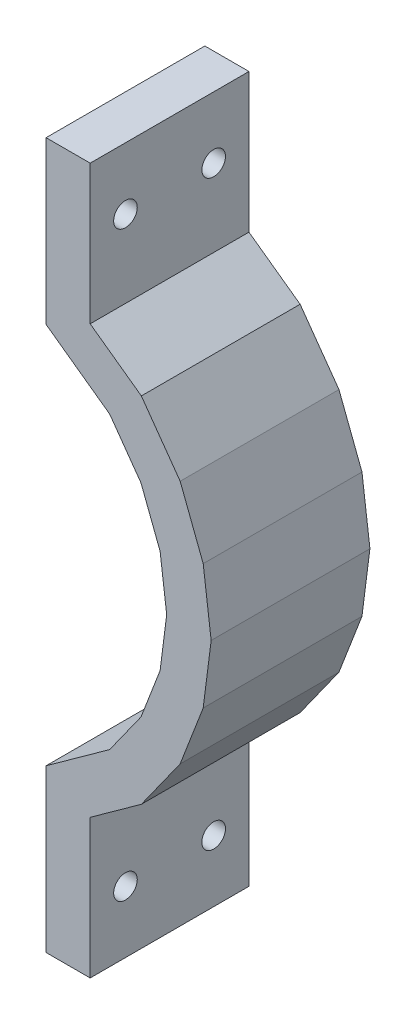
ISO-10303-21;
HEADER;
FILE_DESCRIPTION(('STEP AP214'),'2;1');
FILE_NAME('part.step','',(''),(''),'','','');
FILE_SCHEMA(('AUTOMOTIVE_DESIGN { 1 0 10303 214 1 1 1 1 }'));
ENDSEC;
DATA;
#1=APPLICATION_CONTEXT('core data for automotive mechanical design processes');
#2=APPLICATION_PROTOCOL_DEFINITION('international standard','automotive_design',2000,#1);
#3=PRODUCT_CONTEXT('',#1,'mechanical');
#4=PRODUCT('Part','Part','',(#3));
#5=PRODUCT_RELATED_PRODUCT_CATEGORY('part','',(#4));
#6=PRODUCT_DEFINITION_FORMATION('','',#4);
#7=PRODUCT_DEFINITION_CONTEXT('part definition',#1,'design');
#8=PRODUCT_DEFINITION('design','',#6,#7);
#9=PRODUCT_DEFINITION_SHAPE('','',#8);
#10=(LENGTH_UNIT() NAMED_UNIT(*) SI_UNIT(.MILLI.,.METRE.));
#11=(NAMED_UNIT(*) PLANE_ANGLE_UNIT() SI_UNIT($,.RADIAN.));
#12=(NAMED_UNIT(*) SI_UNIT($,.STERADIAN.) SOLID_ANGLE_UNIT());
#13=UNCERTAINTY_MEASURE_WITH_UNIT(LENGTH_MEASURE(1.E-05),#10,'distance_accuracy_value','');
#14=(GEOMETRIC_REPRESENTATION_CONTEXT(3) GLOBAL_UNCERTAINTY_ASSIGNED_CONTEXT((#13)) GLOBAL_UNIT_ASSIGNED_CONTEXT((#10,
#11,#12)) REPRESENTATION_CONTEXT('',''));
#15=CARTESIAN_POINT('',(0.,0.,0.));
#16=DIRECTION('',(0.,0.,1.));
#17=DIRECTION('',(1.,0.,0.));
#18=AXIS2_PLACEMENT_3D('',#15,#16,#17);
#19=CARTESIAN_POINT('',(35.3594623596526,-33.0325366885821,22.86));
#20=DIRECTION('',(1.,0.,0.));
#21=DIRECTION('',(0.,1.,0.));
#22=AXIS2_PLACEMENT_3D('',#19,#20,#21);
#23=PLANE('',#22);
#24=CARTESIAN_POINT('',(35.3594623596526,-47.42813206681,17.78));
#25=DIRECTION('',(1.,0.,0.));
#26=DIRECTION('',(0.,0.,-1.));
#27=AXIS2_PLACEMENT_3D('',#24,#25,#26);
#28=CIRCLE('',#27,1.69999999999999);
#29=CARTESIAN_POINT('',(35.3594623596526,-47.42813206681,16.08));
#30=VERTEX_POINT('',#29);
#31=EDGE_CURVE('E393',#30,#30,#28,.T.);
#32=ORIENTED_EDGE('',*,*,#31,.T.);
#33=EDGE_LOOP('',(#32));
#34=FACE_BOUND('',#33,.T.);
#35=CARTESIAN_POINT('',(35.3594623596526,-47.42813206681,5.08));
#36=DIRECTION('',(1.,0.,0.));
#37=DIRECTION('',(0.,0.,-1.));
#38=AXIS2_PLACEMENT_3D('',#35,#36,#37);
#39=CIRCLE('',#38,1.69999999999999);
#40=CARTESIAN_POINT('',(35.3594623596526,-47.42813206681,3.38000000000001));
#41=VERTEX_POINT('',#40);
#42=EDGE_CURVE('E218',#41,#41,#39,.T.);
#43=ORIENTED_EDGE('',*,*,#42,.T.);
#44=EDGE_LOOP('',(#43));
#45=FACE_BOUND('',#44,.T.);
#46=DIRECTION('',(0.,-1.,0.));
#47=VECTOR('',#46,1.);
#48=CARTESIAN_POINT('',(35.3594623596526,-33.0325366885821,0.));
#49=LINE('',#48,#47);
#50=CARTESIAN_POINT('',(35.3594623596526,-33.0325366885821,0.));
#51=VERTEX_POINT('',#50);
#52=CARTESIAN_POINT('',(35.3594623596526,-56.31813206681,0.));
#53=VERTEX_POINT('',#52);
#54=EDGE_CURVE('E214',#51,#53,#49,.T.);
#55=ORIENTED_EDGE('',*,*,#54,.T.);
#56=DIRECTION('',(0.,0.,-1.));
#57=VECTOR('',#56,1.);
#58=CARTESIAN_POINT('',(35.3594623596526,-56.31813206681,22.86));
#59=LINE('',#58,#57);
#60=CARTESIAN_POINT('',(35.3594623596526,-56.31813206681,22.86));
#61=VERTEX_POINT('',#60);
#62=EDGE_CURVE('E11',#61,#53,#59,.T.);
#63=ORIENTED_EDGE('',*,*,#62,.F.);
#64=DIRECTION('',(0.,-1.,0.));
#65=VECTOR('',#64,1.);
#66=CARTESIAN_POINT('',(35.3594623596526,-33.0325366885821,22.86));
#67=LINE('',#66,#65);
#68=CARTESIAN_POINT('',(35.3594623596526,-33.0325366885821,22.86));
#69=VERTEX_POINT('',#68);
#70=EDGE_CURVE('E257',#69,#61,#67,.T.);
#71=ORIENTED_EDGE('',*,*,#70,.F.);
#72=DIRECTION('',(0.,0.,-1.));
#73=VECTOR('',#72,1.);
#74=CARTESIAN_POINT('',(35.3594623596526,-33.0325366885821,22.86));
#75=LINE('',#74,#73);
#76=EDGE_CURVE('E210',#69,#51,#75,.T.);
#77=ORIENTED_EDGE('',*,*,#76,.T.);
#78=EDGE_LOOP('',(#55,#63,#71,#77));
#79=FACE_BOUND('',#78,.T.);
#80=ADVANCED_FACE('F34',(#34,#45,#79),#23,.F.);
#81=CARTESIAN_POINT('',(35.3594623596526,-56.31813206681,22.86));
#82=DIRECTION('',(0.,1.,0.));
#83=DIRECTION('',(0.,0.,1.));
#84=AXIS2_PLACEMENT_3D('',#81,#82,#83);
#85=PLANE('',#84);
#86=DIRECTION('',(1.,0.,0.));
#87=VECTOR('',#86,1.);
#88=CARTESIAN_POINT('',(35.3594623596526,-56.31813206681,0.));
#89=LINE('',#88,#87);
#90=CARTESIAN_POINT('',(41.7094623596526,-56.31813206681,0.));
#91=VERTEX_POINT('',#90);
#92=EDGE_CURVE('E217',#53,#91,#89,.T.);
#93=ORIENTED_EDGE('',*,*,#92,.T.);
#94=DIRECTION('',(0.,0.,-1.));
#95=VECTOR('',#94,1.);
#96=CARTESIAN_POINT('',(41.7094623596526,-56.31813206681,22.86));
#97=LINE('',#96,#95);
#98=CARTESIAN_POINT('',(41.7094623596526,-56.31813206681,22.86));
#99=VERTEX_POINT('',#98);
#100=EDGE_CURVE('E42',#99,#91,#97,.T.);
#101=ORIENTED_EDGE('',*,*,#100,.F.);
#102=DIRECTION('',(1.,0.,0.));
#103=VECTOR('',#102,1.);
#104=CARTESIAN_POINT('',(35.3594623596526,-56.31813206681,22.86));
#105=LINE('',#104,#103);
#106=EDGE_CURVE('E135',#61,#99,#105,.T.);
#107=ORIENTED_EDGE('',*,*,#106,.F.);
#108=ORIENTED_EDGE('',*,*,#62,.T.);
#109=EDGE_LOOP('',(#93,#101,#107,#108));
#110=FACE_BOUND('',#109,.T.);
#111=ADVANCED_FACE('F385',(#110),#85,.F.);
#112=CARTESIAN_POINT('',(41.7094623596526,-56.31813206681,22.86));
#113=DIRECTION('',(-1.,0.,0.));
#114=DIRECTION('',(0.,0.,1.));
#115=AXIS2_PLACEMENT_3D('',#112,#113,#114);
#116=PLANE('',#115);
#117=CARTESIAN_POINT('',(41.7094623596526,-47.42813206681,17.78));
#118=DIRECTION('',(1.,0.,0.));
#119=DIRECTION('',(0.,0.,-1.));
#120=AXIS2_PLACEMENT_3D('',#117,#118,#119);
#121=CIRCLE('',#120,1.69999999999999);
#122=CARTESIAN_POINT('',(41.7094623596526,-47.42813206681,16.08));
#123=VERTEX_POINT('',#122);
#124=EDGE_CURVE('E405',#123,#123,#121,.T.);
#125=ORIENTED_EDGE('',*,*,#124,.F.);
#126=EDGE_LOOP('',(#125));
#127=FACE_BOUND('',#126,.T.);
#128=CARTESIAN_POINT('',(41.7094623596526,-47.42813206681,5.08));
#129=DIRECTION('',(1.,0.,0.));
#130=DIRECTION('',(0.,0.,-1.));
#131=AXIS2_PLACEMENT_3D('',#128,#129,#130);
#132=CIRCLE('',#131,1.69999999999999);
#133=CARTESIAN_POINT('',(41.7094623596526,-47.42813206681,3.38000000000001));
#134=VERTEX_POINT('',#133);
#135=EDGE_CURVE('E397',#134,#134,#132,.T.);
#136=ORIENTED_EDGE('',*,*,#135,.F.);
#137=EDGE_LOOP('',(#136));
#138=FACE_BOUND('',#137,.T.);
#139=DIRECTION('',(0.,1.,0.));
#140=VECTOR('',#139,1.);
#141=CARTESIAN_POINT('',(41.7094623596526,-56.31813206681,0.));
#142=LINE('',#141,#140);
#143=CARTESIAN_POINT('',(41.7094623596526,-36.2837913650377,0.));
#144=VERTEX_POINT('',#143);
#145=EDGE_CURVE('E220',#91,#144,#142,.T.);
#146=ORIENTED_EDGE('',*,*,#145,.T.);
#147=DIRECTION('',(0.,0.,-1.));
#148=VECTOR('',#147,1.);
#149=CARTESIAN_POINT('',(41.7094623596526,-36.2837913650377,22.86));
#150=LINE('',#149,#148);
#151=CARTESIAN_POINT('',(41.7094623596526,-36.2837913650377,22.86));
#152=VERTEX_POINT('',#151);
#153=EDGE_CURVE('E306',#152,#144,#150,.T.);
#154=ORIENTED_EDGE('',*,*,#153,.F.);
#155=DIRECTION('',(0.,1.,0.));
#156=VECTOR('',#155,1.);
#157=CARTESIAN_POINT('',(41.7094623596526,-56.31813206681,22.86));
#158=LINE('',#157,#156);
#159=EDGE_CURVE('E314',#99,#152,#158,.T.);
#160=ORIENTED_EDGE('',*,*,#159,.F.);
#161=ORIENTED_EDGE('',*,*,#100,.T.);
#162=EDGE_LOOP('',(#146,#154,#160,#161));
#163=FACE_BOUND('',#162,.T.);
#164=ADVANCED_FACE('F312',(#127,#138,#163),#116,.F.);
#165=CARTESIAN_POINT('',(41.7094623596526,-36.2837913650377,22.86));
#166=DIRECTION('',(-0.584594173351775,0.811325860849483,0.));
#167=DIRECTION('',(-0.811325860849483,-0.584594173351775,0.));
#168=AXIS2_PLACEMENT_3D('',#165,#166,#167);
#169=PLANE('',#168);
#170=DIRECTION('',(0.811325860849483,0.584594173351775,0.));
#171=VECTOR('',#170,1.);
#172=CARTESIAN_POINT('',(41.7094623596526,-36.2837913650377,0.));
#173=LINE('',#172,#171);
#174=CARTESIAN_POINT('',(49.0748372221447,-30.9767311110279,0.));
#175=VERTEX_POINT('',#174);
#176=EDGE_CURVE('E222',#144,#175,#173,.T.);
#177=ORIENTED_EDGE('',*,*,#176,.T.);
#178=DIRECTION('',(0.,0.,-1.));
#179=VECTOR('',#178,1.);
#180=CARTESIAN_POINT('',(49.0748372221447,-30.9767311110279,22.86));
#181=LINE('',#180,#179);
#182=CARTESIAN_POINT('',(49.0748372221447,-30.9767311110279,22.86));
#183=VERTEX_POINT('',#182);
#184=EDGE_CURVE('E303',#183,#175,#181,.T.);
#185=ORIENTED_EDGE('',*,*,#184,.F.);
#186=DIRECTION('',(0.811325860849483,0.584594173351775,0.));
#187=VECTOR('',#186,1.);
#188=CARTESIAN_POINT('',(41.7094623596526,-36.2837913650377,22.86));
#189=LINE('',#188,#187);
#190=EDGE_CURVE('E332',#152,#183,#189,.T.);
#191=ORIENTED_EDGE('',*,*,#190,.F.);
#192=ORIENTED_EDGE('',*,*,#153,.T.);
#193=EDGE_LOOP('',(#177,#185,#191,#192));
#194=FACE_BOUND('',#193,.T.);
#195=ADVANCED_FACE('F323',(#194),#169,.F.);
#196=CARTESIAN_POINT('',(49.0748372221447,-30.9767311110279,22.86));
#197=DIRECTION('',(-0.814138939313214,0.580670119339677,0.));
#198=DIRECTION('',(-0.580670119339677,-0.814138939313214,0.));
#199=AXIS2_PLACEMENT_3D('',#196,#197,#198);
#200=PLANE('',#199);
#201=DIRECTION('',(0.580670119339677,0.814138939313214,0.));
#202=VECTOR('',#201,1.);
#203=CARTESIAN_POINT('',(49.0748372221447,-30.9767311110279,0.));
#204=LINE('',#203,#202);
#205=CARTESIAN_POINT('',(54.665181835906,-23.1386883348324,0.));
#206=VERTEX_POINT('',#205);
#207=EDGE_CURVE('E224',#175,#206,#204,.T.);
#208=ORIENTED_EDGE('',*,*,#207,.T.);
#209=DIRECTION('',(0.,0.,-1.));
#210=VECTOR('',#209,1.);
#211=CARTESIAN_POINT('',(54.665181835906,-23.1386883348324,22.86));
#212=LINE('',#211,#210);
#213=CARTESIAN_POINT('',(54.665181835906,-23.1386883348324,22.86));
#214=VERTEX_POINT('',#213);
#215=EDGE_CURVE('E300',#214,#206,#212,.T.);
#216=ORIENTED_EDGE('',*,*,#215,.F.);
#217=DIRECTION('',(0.580670119339677,0.814138939313214,0.));
#218=VECTOR('',#217,1.);
#219=CARTESIAN_POINT('',(49.0748372221447,-30.9767311110279,22.86));
#220=LINE('',#219,#218);
#221=EDGE_CURVE('E329',#183,#214,#220,.T.);
#222=ORIENTED_EDGE('',*,*,#221,.F.);
#223=ORIENTED_EDGE('',*,*,#184,.T.);
#224=EDGE_LOOP('',(#208,#216,#222,#223));
#225=FACE_BOUND('',#224,.T.);
#226=ADVANCED_FACE('F327',(#225),#200,.F.);
#227=CARTESIAN_POINT('',(54.665181835906,-23.1386883348324,22.86));
#228=DIRECTION('',(-0.933394369488488,0.358852269056765,0.));
#229=DIRECTION('',(-0.358852269056765,-0.933394369488488,0.));
#230=AXIS2_PLACEMENT_3D('',#227,#228,#229);
#231=PLANE('',#230);
#232=DIRECTION('',(0.358852269056765,0.933394369488488,0.));
#233=VECTOR('',#232,1.);
#234=CARTESIAN_POINT('',(54.665181835906,-23.1386883348324,0.));
#235=LINE('',#234,#233);
#236=CARTESIAN_POINT('',(57.9800590706334,-14.516511430189,0.));
#237=VERTEX_POINT('',#236);
#238=EDGE_CURVE('E226',#206,#237,#235,.T.);
#239=ORIENTED_EDGE('',*,*,#238,.T.);
#240=DIRECTION('',(0.,0.,-1.));
#241=VECTOR('',#240,1.);
#242=CARTESIAN_POINT('',(57.9800590706334,-14.516511430189,22.86));
#243=LINE('',#242,#241);
#244=CARTESIAN_POINT('',(57.9800590706334,-14.516511430189,22.86));
#245=VERTEX_POINT('',#244);
#246=EDGE_CURVE('E297',#245,#237,#243,.T.);
#247=ORIENTED_EDGE('',*,*,#246,.F.);
#248=DIRECTION('',(0.358852269056765,0.933394369488488,0.));
#249=VECTOR('',#248,1.);
#250=CARTESIAN_POINT('',(54.665181835906,-23.1386883348324,22.86));
#251=LINE('',#250,#249);
#252=EDGE_CURVE('E331',#214,#245,#251,.T.);
#253=ORIENTED_EDGE('',*,*,#252,.F.);
#254=ORIENTED_EDGE('',*,*,#215,.T.);
#255=EDGE_LOOP('',(#239,#247,#253,#254));
#256=FACE_BOUND('',#255,.T.);
#257=ADVANCED_FACE('F477',(#256),#231,.F.);
#258=CARTESIAN_POINT('',(57.9800590706334,-14.516511430189,22.86));
#259=DIRECTION('',(-0.991996900043617,0.126262228333946,0.));
#260=DIRECTION('',(-0.126262228333946,-0.991996900043617,0.));
#261=AXIS2_PLACEMENT_3D('',#258,#259,#260);
#262=PLANE('',#261);
#263=DIRECTION('',(0.126262228333946,0.991996900043617,0.));
#264=VECTOR('',#263,1.);
#265=CARTESIAN_POINT('',(57.9800590706334,-14.516511430189,0.));
#266=LINE('',#265,#264);
#267=CARTESIAN_POINT('',(59.1253806233162,-5.5181320668099,0.));
#268=VERTEX_POINT('',#267);
#269=EDGE_CURVE('E228',#237,#268,#266,.T.);
#270=ORIENTED_EDGE('',*,*,#269,.T.);
#271=DIRECTION('',(0.,0.,-1.));
#272=VECTOR('',#271,1.);
#273=CARTESIAN_POINT('',(59.1253806233162,-5.5181320668099,22.86));
#274=LINE('',#273,#272);
#275=CARTESIAN_POINT('',(59.1253806233162,-5.5181320668099,22.86));
#276=VERTEX_POINT('',#275);
#277=EDGE_CURVE('E294',#276,#268,#274,.T.);
#278=ORIENTED_EDGE('',*,*,#277,.F.);
#279=DIRECTION('',(0.126262228333946,0.991996900043617,0.));
#280=VECTOR('',#279,1.);
#281=CARTESIAN_POINT('',(57.9800590706334,-14.516511430189,22.86));
#282=LINE('',#281,#280);
#283=EDGE_CURVE('E334',#245,#276,#282,.T.);
#284=ORIENTED_EDGE('',*,*,#283,.F.);
#285=ORIENTED_EDGE('',*,*,#246,.T.);
#286=EDGE_LOOP('',(#270,#278,#284,#285));
#287=FACE_BOUND('',#286,.T.);
#288=ADVANCED_FACE('F473',(#287),#262,.F.);
#289=CARTESIAN_POINT('',(57.9800590706334,3.48024729656917,22.86));
#290=DIRECTION('',(-0.991996900043617,-0.126262228333946,0.));
#291=DIRECTION('',(0.126262228333946,-0.991996900043617,0.));
#292=AXIS2_PLACEMENT_3D('',#289,#290,#291);
#293=PLANE('',#292);
#294=DIRECTION('',(-0.126262228333946,0.991996900043617,0.));
#295=VECTOR('',#294,1.);
#296=CARTESIAN_POINT('',(57.9800590706334,3.48024729656917,0.));
#297=LINE('',#296,#295);
#298=CARTESIAN_POINT('',(57.9800590706334,3.48024729656917,0.));
#299=VERTEX_POINT('',#298);
#300=EDGE_CURVE('E230',#268,#299,#297,.T.);
#301=ORIENTED_EDGE('',*,*,#300,.T.);
#302=DIRECTION('',(0.,0.,-1.));
#303=VECTOR('',#302,1.);
#304=CARTESIAN_POINT('',(57.9800590706334,3.48024729656917,22.86));
#305=LINE('',#304,#303);
#306=CARTESIAN_POINT('',(57.9800590706334,3.48024729656917,22.86));
#307=VERTEX_POINT('',#306);
#308=EDGE_CURVE('E291',#307,#299,#305,.T.);
#309=ORIENTED_EDGE('',*,*,#308,.F.);
#310=DIRECTION('',(-0.126262228333946,0.991996900043617,0.));
#311=VECTOR('',#310,1.);
#312=CARTESIAN_POINT('',(57.9800590706334,3.48024729656917,22.86));
#313=LINE('',#312,#311);
#314=EDGE_CURVE('E340',#276,#307,#313,.T.);
#315=ORIENTED_EDGE('',*,*,#314,.F.);
#316=ORIENTED_EDGE('',*,*,#277,.T.);
#317=EDGE_LOOP('',(#301,#309,#315,#316));
#318=FACE_BOUND('',#317,.T.);
#319=ADVANCED_FACE('F469',(#318),#293,.F.);
#320=CARTESIAN_POINT('',(54.665181835906,12.1024242012125,22.86));
#321=DIRECTION('',(-0.933394369488488,-0.358852269056765,0.));
#322=DIRECTION('',(0.358852269056765,-0.933394369488488,0.));
#323=AXIS2_PLACEMENT_3D('',#320,#321,#322);
#324=PLANE('',#323);
#325=DIRECTION('',(-0.358852269056765,0.933394369488488,0.));
#326=VECTOR('',#325,1.);
#327=CARTESIAN_POINT('',(54.665181835906,12.1024242012125,0.));
#328=LINE('',#327,#326);
#329=CARTESIAN_POINT('',(54.665181835906,12.1024242012125,0.));
#330=VERTEX_POINT('',#329);
#331=EDGE_CURVE('E232',#299,#330,#328,.T.);
#332=ORIENTED_EDGE('',*,*,#331,.T.);
#333=DIRECTION('',(0.,0.,-1.));
#334=VECTOR('',#333,1.);
#335=CARTESIAN_POINT('',(54.665181835906,12.1024242012125,22.86));
#336=LINE('',#335,#334);
#337=CARTESIAN_POINT('',(54.665181835906,12.1024242012125,22.86));
#338=VERTEX_POINT('',#337);
#339=EDGE_CURVE('E288',#338,#330,#336,.T.);
#340=ORIENTED_EDGE('',*,*,#339,.F.);
#341=DIRECTION('',(-0.358852269056765,0.933394369488488,0.));
#342=VECTOR('',#341,1.);
#343=CARTESIAN_POINT('',(54.665181835906,12.1024242012125,22.86));
#344=LINE('',#343,#342);
#345=EDGE_CURVE('E342',#307,#338,#344,.T.);
#346=ORIENTED_EDGE('',*,*,#345,.F.);
#347=ORIENTED_EDGE('',*,*,#308,.T.);
#348=EDGE_LOOP('',(#332,#340,#346,#347));
#349=FACE_BOUND('',#348,.T.);
#350=ADVANCED_FACE('F465',(#349),#324,.F.);
#351=CARTESIAN_POINT('',(49.0748372221447,19.9404669774081,22.86));
#352=DIRECTION('',(-0.814138939313214,-0.580670119339677,0.));
#353=DIRECTION('',(0.580670119339677,-0.814138939313214,0.));
#354=AXIS2_PLACEMENT_3D('',#351,#352,#353);
#355=PLANE('',#354);
#356=DIRECTION('',(-0.580670119339677,0.814138939313214,0.));
#357=VECTOR('',#356,1.);
#358=CARTESIAN_POINT('',(49.0748372221447,19.9404669774081,0.));
#359=LINE('',#358,#357);
#360=CARTESIAN_POINT('',(49.0748372221447,19.9404669774081,0.));
#361=VERTEX_POINT('',#360);
#362=EDGE_CURVE('E234',#330,#361,#359,.T.);
#363=ORIENTED_EDGE('',*,*,#362,.T.);
#364=DIRECTION('',(0.,0.,-1.));
#365=VECTOR('',#364,1.);
#366=CARTESIAN_POINT('',(49.0748372221447,19.9404669774081,22.86));
#367=LINE('',#366,#365);
#368=CARTESIAN_POINT('',(49.0748372221447,19.9404669774081,22.86));
#369=VERTEX_POINT('',#368);
#370=EDGE_CURVE('E285',#369,#361,#367,.T.);
#371=ORIENTED_EDGE('',*,*,#370,.F.);
#372=DIRECTION('',(-0.580670119339677,0.814138939313214,0.));
#373=VECTOR('',#372,1.);
#374=CARTESIAN_POINT('',(49.0748372221447,19.9404669774081,22.86));
#375=LINE('',#374,#373);
#376=EDGE_CURVE('E344',#338,#369,#375,.T.);
#377=ORIENTED_EDGE('',*,*,#376,.F.);
#378=ORIENTED_EDGE('',*,*,#339,.T.);
#379=EDGE_LOOP('',(#363,#371,#377,#378));
#380=FACE_BOUND('',#379,.T.);
#381=ADVANCED_FACE('F461',(#380),#355,.F.);
#382=CARTESIAN_POINT('',(41.7094623596526,25.2475272314178,22.86));
#383=DIRECTION('',(-0.584594173351776,-0.811325860849482,0.));
#384=DIRECTION('',(0.811325860849482,-0.584594173351776,0.));
#385=AXIS2_PLACEMENT_3D('',#382,#383,#384);
#386=PLANE('',#385);
#387=DIRECTION('',(-0.811325860849482,0.584594173351776,0.));
#388=VECTOR('',#387,1.);
#389=CARTESIAN_POINT('',(41.7094623596526,25.2475272314178,0.));
#390=LINE('',#389,#388);
#391=CARTESIAN_POINT('',(41.7094623596526,25.2475272314178,0.));
#392=VERTEX_POINT('',#391);
#393=EDGE_CURVE('E236',#361,#392,#390,.T.);
#394=ORIENTED_EDGE('',*,*,#393,.T.);
#395=DIRECTION('',(0.,0.,-1.));
#396=VECTOR('',#395,1.);
#397=CARTESIAN_POINT('',(41.7094623596526,25.2475272314178,22.86));
#398=LINE('',#397,#396);
#399=CARTESIAN_POINT('',(41.7094623596526,25.2475272314178,22.86));
#400=VERTEX_POINT('',#399);
#401=EDGE_CURVE('E282',#400,#392,#398,.T.);
#402=ORIENTED_EDGE('',*,*,#401,.F.);
#403=DIRECTION('',(-0.811325860849482,0.584594173351776,0.));
#404=VECTOR('',#403,1.);
#405=CARTESIAN_POINT('',(41.7094623596526,25.2475272314178,22.86));
#406=LINE('',#405,#404);
#407=EDGE_CURVE('E346',#369,#400,#406,.T.);
#408=ORIENTED_EDGE('',*,*,#407,.F.);
#409=ORIENTED_EDGE('',*,*,#370,.T.);
#410=EDGE_LOOP('',(#394,#402,#408,#409));
#411=FACE_BOUND('',#410,.T.);
#412=ADVANCED_FACE('F427',(#411),#386,.F.);
#413=CARTESIAN_POINT('',(41.7094623596526,25.2475272314178,22.86));
#414=DIRECTION('',(-1.,0.,0.));
#415=DIRECTION('',(0.,-1.,0.));
#416=AXIS2_PLACEMENT_3D('',#413,#414,#415);
#417=PLANE('',#416);
#418=CARTESIAN_POINT('',(41.7094623596526,36.39186793319,17.78));
#419=DIRECTION('',(1.,0.,0.));
#420=DIRECTION('',(0.,0.,-1.));
#421=AXIS2_PLACEMENT_3D('',#418,#419,#420);
#422=CIRCLE('',#421,1.69999999999999);
#423=CARTESIAN_POINT('',(41.7094623596526,36.39186793319,16.08));
#424=VERTEX_POINT('',#423);
#425=EDGE_CURVE('E417',#424,#424,#422,.T.);
#426=ORIENTED_EDGE('',*,*,#425,.F.);
#427=EDGE_LOOP('',(#426));
#428=FACE_BOUND('',#427,.T.);
#429=CARTESIAN_POINT('',(41.7094623596526,36.39186793319,5.08));
#430=DIRECTION('',(1.,0.,0.));
#431=DIRECTION('',(0.,0.,-1.));
#432=AXIS2_PLACEMENT_3D('',#429,#430,#431);
#433=CIRCLE('',#432,1.69999999999999);
#434=CARTESIAN_POINT('',(41.7094623596526,36.39186793319,3.38000000000001));
#435=VERTEX_POINT('',#434);
#436=EDGE_CURVE('E411',#435,#435,#433,.T.);
#437=ORIENTED_EDGE('',*,*,#436,.F.);
#438=EDGE_LOOP('',(#437));
#439=FACE_BOUND('',#438,.T.);
#440=DIRECTION('',(0.,1.,0.));
#441=VECTOR('',#440,1.);
#442=CARTESIAN_POINT('',(41.7094623596526,25.2475272314178,0.));
#443=LINE('',#442,#441);
#444=CARTESIAN_POINT('',(41.7094623596526,45.28186793319,0.));
#445=VERTEX_POINT('',#444);
#446=EDGE_CURVE('E238',#392,#445,#443,.T.);
#447=ORIENTED_EDGE('',*,*,#446,.T.);
#448=DIRECTION('',(0.,0.,-1.));
#449=VECTOR('',#448,1.);
#450=CARTESIAN_POINT('',(41.7094623596526,45.28186793319,22.86));
#451=LINE('',#450,#449);
#452=CARTESIAN_POINT('',(41.7094623596526,45.28186793319,22.86));
#453=VERTEX_POINT('',#452);
#454=EDGE_CURVE('E279',#453,#445,#451,.T.);
#455=ORIENTED_EDGE('',*,*,#454,.F.);
#456=DIRECTION('',(0.,1.,0.));
#457=VECTOR('',#456,1.);
#458=CARTESIAN_POINT('',(41.7094623596526,25.2475272314178,22.86));
#459=LINE('',#458,#457);
#460=EDGE_CURVE('E348',#400,#453,#459,.T.);
#461=ORIENTED_EDGE('',*,*,#460,.F.);
#462=ORIENTED_EDGE('',*,*,#401,.T.);
#463=EDGE_LOOP('',(#447,#455,#461,#462));
#464=FACE_BOUND('',#463,.T.);
#465=ADVANCED_FACE('F423',(#428,#439,#464),#417,.F.);
#466=CARTESIAN_POINT('',(35.3594623596526,45.28186793319,22.86));
#467=DIRECTION('',(0.,-1.,0.));
#468=DIRECTION('',(0.,0.,-1.));
#469=AXIS2_PLACEMENT_3D('',#466,#467,#468);
#470=PLANE('',#469);
#471=DIRECTION('',(-1.,0.,0.));
#472=VECTOR('',#471,1.);
#473=CARTESIAN_POINT('',(35.3594623596526,45.28186793319,0.));
#474=LINE('',#473,#472);
#475=CARTESIAN_POINT('',(35.3594623596526,45.28186793319,0.));
#476=VERTEX_POINT('',#475);
#477=EDGE_CURVE('E240',#445,#476,#474,.T.);
#478=ORIENTED_EDGE('',*,*,#477,.T.);
#479=DIRECTION('',(0.,0.,-1.));
#480=VECTOR('',#479,1.);
#481=CARTESIAN_POINT('',(35.3594623596526,45.28186793319,22.86));
#482=LINE('',#481,#480);
#483=CARTESIAN_POINT('',(35.3594623596526,45.28186793319,22.86));
#484=VERTEX_POINT('',#483);
#485=EDGE_CURVE('E276',#484,#476,#482,.T.);
#486=ORIENTED_EDGE('',*,*,#485,.F.);
#487=DIRECTION('',(-1.,0.,0.));
#488=VECTOR('',#487,1.);
#489=CARTESIAN_POINT('',(35.3594623596526,45.28186793319,22.86));
#490=LINE('',#489,#488);
#491=EDGE_CURVE('E350',#453,#484,#490,.T.);
#492=ORIENTED_EDGE('',*,*,#491,.F.);
#493=ORIENTED_EDGE('',*,*,#454,.T.);
#494=EDGE_LOOP('',(#478,#486,#492,#493));
#495=FACE_BOUND('',#494,.T.);
#496=ADVANCED_FACE('F426',(#495),#470,.F.);
#497=CARTESIAN_POINT('',(35.3594623596526,45.28186793319,22.86));
#498=DIRECTION('',(1.,0.,0.));
#499=DIRECTION('',(0.,1.,0.));
#500=AXIS2_PLACEMENT_3D('',#497,#498,#499);
#501=PLANE('',#500);
#502=CARTESIAN_POINT('',(35.3594623596526,36.39186793319,17.78));
#503=DIRECTION('',(1.,0.,0.));
#504=DIRECTION('',(0.,0.,-1.));
#505=AXIS2_PLACEMENT_3D('',#502,#503,#504);
#506=CIRCLE('',#505,1.69999999999999);
#507=CARTESIAN_POINT('',(35.3594623596526,36.39186793319,16.08));
#508=VERTEX_POINT('',#507);
#509=EDGE_CURVE('E414',#508,#508,#506,.T.);
#510=ORIENTED_EDGE('',*,*,#509,.T.);
#511=EDGE_LOOP('',(#510));
#512=FACE_BOUND('',#511,.T.);
#513=CARTESIAN_POINT('',(35.3594623596526,36.39186793319,5.08));
#514=DIRECTION('',(1.,0.,0.));
#515=DIRECTION('',(0.,0.,-1.));
#516=AXIS2_PLACEMENT_3D('',#513,#514,#515);
#517=CIRCLE('',#516,1.69999999999999);
#518=CARTESIAN_POINT('',(35.3594623596526,36.39186793319,3.38000000000001));
#519=VERTEX_POINT('',#518);
#520=EDGE_CURVE('E408',#519,#519,#517,.T.);
#521=ORIENTED_EDGE('',*,*,#520,.T.);
#522=EDGE_LOOP('',(#521));
#523=FACE_BOUND('',#522,.T.);
#524=DIRECTION('',(0.,-1.,0.));
#525=VECTOR('',#524,1.);
#526=CARTESIAN_POINT('',(35.3594623596526,45.28186793319,0.));
#527=LINE('',#526,#525);
#528=CARTESIAN_POINT('',(35.3594623596526,21.9962725549622,0.));
#529=VERTEX_POINT('',#528);
#530=EDGE_CURVE('E242',#476,#529,#527,.T.);
#531=ORIENTED_EDGE('',*,*,#530,.T.);
#532=DIRECTION('',(0.,0.,-1.));
#533=VECTOR('',#532,1.);
#534=CARTESIAN_POINT('',(35.3594623596526,21.9962725549622,22.86));
#535=LINE('',#534,#533);
#536=CARTESIAN_POINT('',(35.3594623596526,21.9962725549622,22.86));
#537=VERTEX_POINT('',#536);
#538=EDGE_CURVE('E273',#537,#529,#535,.T.);
#539=ORIENTED_EDGE('',*,*,#538,.F.);
#540=DIRECTION('',(0.,-1.,0.));
#541=VECTOR('',#540,1.);
#542=CARTESIAN_POINT('',(35.3594623596526,45.28186793319,22.86));
#543=LINE('',#542,#541);
#544=EDGE_CURVE('E352',#484,#537,#543,.T.);
#545=ORIENTED_EDGE('',*,*,#544,.F.);
#546=ORIENTED_EDGE('',*,*,#485,.T.);
#547=EDGE_LOOP('',(#531,#539,#545,#546));
#548=FACE_BOUND('',#547,.T.);
#549=ADVANCED_FACE('F445',(#512,#523,#548),#501,.F.);
#550=CARTESIAN_POINT('',(35.3594623596526,21.9962725549622,22.86));
#551=DIRECTION('',(0.584594173351775,0.811325860849483,0.));
#552=DIRECTION('',(-0.811325860849483,0.584594173351775,0.));
#553=AXIS2_PLACEMENT_3D('',#550,#551,#552);
#554=PLANE('',#553);
#555=DIRECTION('',(0.811325860849483,-0.584594173351775,0.));
#556=VECTOR('',#555,1.);
#557=CARTESIAN_POINT('',(35.3594623596526,21.9962725549622,0.));
#558=LINE('',#557,#556);
#559=CARTESIAN_POINT('',(44.5130956108117,15.400697432996,0.));
#560=VERTEX_POINT('',#559);
#561=EDGE_CURVE('E244',#529,#560,#558,.T.);
#562=ORIENTED_EDGE('',*,*,#561,.T.);
#563=DIRECTION('',(0.,0.,-1.));
#564=VECTOR('',#563,1.);
#565=CARTESIAN_POINT('',(44.5130956108117,15.400697432996,22.86));
#566=LINE('',#565,#564);
#567=CARTESIAN_POINT('',(44.5130956108117,15.400697432996,22.86));
#568=VERTEX_POINT('',#567);
#569=EDGE_CURVE('E270',#568,#560,#566,.T.);
#570=ORIENTED_EDGE('',*,*,#569,.F.);
#571=DIRECTION('',(0.811325860849483,-0.584594173351775,0.));
#572=VECTOR('',#571,1.);
#573=CARTESIAN_POINT('',(35.3594623596526,21.9962725549622,22.86));
#574=LINE('',#573,#572);
#575=EDGE_CURVE('E354',#537,#568,#574,.T.);
#576=ORIENTED_EDGE('',*,*,#575,.F.);
#577=ORIENTED_EDGE('',*,*,#538,.T.);
#578=EDGE_LOOP('',(#562,#570,#576,#577));
#579=FACE_BOUND('',#578,.T.);
#580=ADVANCED_FACE('F449',(#579),#554,.F.);
#581=CARTESIAN_POINT('',(44.5130956108117,15.400697432996,22.86));
#582=DIRECTION('',(0.814138939313214,0.580670119339677,0.));
#583=DIRECTION('',(-0.580670119339677,0.814138939313214,0.));
#584=AXIS2_PLACEMENT_3D('',#581,#582,#583);
#585=PLANE('',#584);
#586=DIRECTION('',(0.580670119339677,-0.814138939313214,0.));
#587=VECTOR('',#586,1.);
#588=CARTESIAN_POINT('',(44.5130956108117,15.400697432996,0.));
#589=LINE('',#588,#587);
#590=CARTESIAN_POINT('',(49.0273689874656,9.07137960479735,0.));
#591=VERTEX_POINT('',#590);
#592=EDGE_CURVE('E246',#560,#591,#589,.T.);
#593=ORIENTED_EDGE('',*,*,#592,.T.);
#594=DIRECTION('',(0.,0.,-1.));
#595=VECTOR('',#594,1.);
#596=CARTESIAN_POINT('',(49.0273689874656,9.07137960479735,22.86));
#597=LINE('',#596,#595);
#598=CARTESIAN_POINT('',(49.0273689874656,9.07137960479735,22.86));
#599=VERTEX_POINT('',#598);
#600=EDGE_CURVE('E267',#599,#591,#597,.T.);
#601=ORIENTED_EDGE('',*,*,#600,.F.);
#602=DIRECTION('',(0.580670119339677,-0.814138939313214,0.));
#603=VECTOR('',#602,1.);
#604=CARTESIAN_POINT('',(44.5130956108117,15.400697432996,22.86));
#605=LINE('',#604,#603);
#606=EDGE_CURVE('E356',#568,#599,#605,.T.);
#607=ORIENTED_EDGE('',*,*,#606,.F.);
#608=ORIENTED_EDGE('',*,*,#569,.T.);
#609=EDGE_LOOP('',(#593,#601,#607,#608));
#610=FACE_BOUND('',#609,.T.);
#611=ADVANCED_FACE('F528',(#610),#585,.F.);
#612=CARTESIAN_POINT('',(49.0273689874656,9.07137960479735,22.86));
#613=DIRECTION('',(0.933394369488488,0.358852269056764,0.));
#614=DIRECTION('',(-0.358852269056764,0.933394369488488,0.));
#615=AXIS2_PLACEMENT_3D('',#612,#613,#614);
#616=PLANE('',#615);
#617=DIRECTION('',(0.358852269056764,-0.933394369488488,0.));
#618=VECTOR('',#617,1.);
#619=CARTESIAN_POINT('',(49.0273689874656,9.07137960479735,0.));
#620=LINE('',#619,#618);
#621=CARTESIAN_POINT('',(51.7777331411746,1.91753208458322,0.));
#622=VERTEX_POINT('',#621);
#623=EDGE_CURVE('E248',#591,#622,#620,.T.);
#624=ORIENTED_EDGE('',*,*,#623,.T.);
#625=DIRECTION('',(0.,0.,-1.));
#626=VECTOR('',#625,1.);
#627=CARTESIAN_POINT('',(51.7777331411746,1.91753208458322,22.86));
#628=LINE('',#627,#626);
#629=CARTESIAN_POINT('',(51.7777331411746,1.91753208458322,22.86));
#630=VERTEX_POINT('',#629);
#631=EDGE_CURVE('E264',#630,#622,#628,.T.);
#632=ORIENTED_EDGE('',*,*,#631,.F.);
#633=DIRECTION('',(0.358852269056764,-0.933394369488488,0.));
#634=VECTOR('',#633,1.);
#635=CARTESIAN_POINT('',(49.0273689874656,9.07137960479735,22.86));
#636=LINE('',#635,#634);
#637=EDGE_CURVE('E358',#599,#630,#636,.T.);
#638=ORIENTED_EDGE('',*,*,#637,.F.);
#639=ORIENTED_EDGE('',*,*,#600,.T.);
#640=EDGE_LOOP('',(#624,#632,#638,#639));
#641=FACE_BOUND('',#640,.T.);
#642=ADVANCED_FACE('F579',(#641),#616,.F.);
#643=CARTESIAN_POINT('',(51.7777331411746,1.91753208458322,22.86));
#644=DIRECTION('',(0.991996900043617,0.126262228333946,0.));
#645=DIRECTION('',(-0.126262228333946,0.991996900043617,0.));
#646=AXIS2_PLACEMENT_3D('',#643,#644,#645);
#647=PLANE('',#646);
#648=DIRECTION('',(0.126262228333946,-0.991996900043617,0.));
#649=VECTOR('',#648,1.);
#650=CARTESIAN_POINT('',(51.7777331411746,1.91753208458322,0.));
#651=LINE('',#650,#649);
#652=CARTESIAN_POINT('',(52.7241509423355,-5.5181320668099,0.));
#653=VERTEX_POINT('',#652);
#654=EDGE_CURVE('E250',#622,#653,#651,.T.);
#655=ORIENTED_EDGE('',*,*,#654,.T.);
#656=DIRECTION('',(0.,0.,-1.));
#657=VECTOR('',#656,1.);
#658=CARTESIAN_POINT('',(52.7241509423355,-5.5181320668099,22.86));
#659=LINE('',#658,#657);
#660=CARTESIAN_POINT('',(52.7241509423355,-5.5181320668099,22.86));
#661=VERTEX_POINT('',#660);
#662=EDGE_CURVE('E261',#661,#653,#659,.T.);
#663=ORIENTED_EDGE('',*,*,#662,.F.);
#664=DIRECTION('',(0.126262228333946,-0.991996900043617,0.));
#665=VECTOR('',#664,1.);
#666=CARTESIAN_POINT('',(51.7777331411746,1.91753208458322,22.86));
#667=LINE('',#666,#665);
#668=EDGE_CURVE('E360',#630,#661,#667,.T.);
#669=ORIENTED_EDGE('',*,*,#668,.F.);
#670=ORIENTED_EDGE('',*,*,#631,.T.);
#671=EDGE_LOOP('',(#655,#663,#669,#670));
#672=FACE_BOUND('',#671,.T.);
#673=ADVANCED_FACE('F366',(#672),#647,.F.);
#674=CARTESIAN_POINT('',(51.7777331411746,-12.9537962182031,22.86));
#675=DIRECTION('',(0.991996900043617,-0.126262228333946,0.));
#676=DIRECTION('',(0.126262228333946,0.991996900043618,0.));
#677=AXIS2_PLACEMENT_3D('',#674,#675,#676);
#678=PLANE('',#677);
#679=DIRECTION('',(-0.126262228333946,-0.991996900043617,0.));
#680=VECTOR('',#679,1.);
#681=CARTESIAN_POINT('',(51.7777331411746,-12.9537962182031,0.));
#682=LINE('',#681,#680);
#683=CARTESIAN_POINT('',(51.7777331411746,-12.9537962182031,0.));
#684=VERTEX_POINT('',#683);
#685=EDGE_CURVE('E252',#653,#684,#682,.T.);
#686=ORIENTED_EDGE('',*,*,#685,.T.);
#687=DIRECTION('',(0.,0.,-1.));
#688=VECTOR('',#687,1.);
#689=CARTESIAN_POINT('',(51.7777331411746,-12.9537962182031,22.86));
#690=LINE('',#689,#688);
#691=CARTESIAN_POINT('',(51.7777331411746,-12.9537962182031,22.86));
#692=VERTEX_POINT('',#691);
#693=EDGE_CURVE('E205',#692,#684,#690,.T.);
#694=ORIENTED_EDGE('',*,*,#693,.F.);
#695=DIRECTION('',(-0.126262228333946,-0.991996900043617,0.));
#696=VECTOR('',#695,1.);
#697=CARTESIAN_POINT('',(51.7777331411746,-12.9537962182031,22.86));
#698=LINE('',#697,#696);
#699=EDGE_CURVE('E196',#661,#692,#698,.T.);
#700=ORIENTED_EDGE('',*,*,#699,.F.);
#701=ORIENTED_EDGE('',*,*,#662,.T.);
#702=EDGE_LOOP('',(#686,#694,#700,#701));
#703=FACE_BOUND('',#702,.T.);
#704=ADVANCED_FACE('F370',(#703),#678,.F.);
#705=CARTESIAN_POINT('',(49.0273689874656,-20.1076437384172,22.86));
#706=DIRECTION('',(0.933394369488488,-0.358852269056765,0.));
#707=DIRECTION('',(0.358852269056765,0.933394369488488,0.));
#708=AXIS2_PLACEMENT_3D('',#705,#706,#707);
#709=PLANE('',#708);
#710=DIRECTION('',(-0.358852269056765,-0.933394369488488,0.));
#711=VECTOR('',#710,1.);
#712=CARTESIAN_POINT('',(49.0273689874656,-20.1076437384172,0.));
#713=LINE('',#712,#711);
#714=CARTESIAN_POINT('',(49.0273689874656,-20.1076437384172,0.));
#715=VERTEX_POINT('',#714);
#716=EDGE_CURVE('E204',#684,#715,#713,.T.);
#717=ORIENTED_EDGE('',*,*,#716,.T.);
#718=DIRECTION('',(0.,0.,-1.));
#719=VECTOR('',#718,1.);
#720=CARTESIAN_POINT('',(49.0273689874656,-20.1076437384172,22.86));
#721=LINE('',#720,#719);
#722=CARTESIAN_POINT('',(49.0273689874656,-20.1076437384172,22.86));
#723=VERTEX_POINT('',#722);
#724=EDGE_CURVE('E201',#723,#715,#721,.T.);
#725=ORIENTED_EDGE('',*,*,#724,.F.);
#726=DIRECTION('',(-0.358852269056765,-0.933394369488488,0.));
#727=VECTOR('',#726,1.);
#728=CARTESIAN_POINT('',(49.0273689874656,-20.1076437384172,22.86));
#729=LINE('',#728,#727);
#730=EDGE_CURVE('E190',#692,#723,#729,.T.);
#731=ORIENTED_EDGE('',*,*,#730,.F.);
#732=ORIENTED_EDGE('',*,*,#693,.T.);
#733=EDGE_LOOP('',(#717,#725,#731,#732));
#734=FACE_BOUND('',#733,.T.);
#735=ADVANCED_FACE('F202',(#734),#709,.F.);
#736=CARTESIAN_POINT('',(44.5130956108117,-26.4369615666159,22.86));
#737=DIRECTION('',(0.814138939313214,-0.580670119339677,0.));
#738=DIRECTION('',(0.580670119339677,0.814138939313214,0.));
#739=AXIS2_PLACEMENT_3D('',#736,#737,#738);
#740=PLANE('',#739);
#741=DIRECTION('',(-0.580670119339677,-0.814138939313214,0.));
#742=VECTOR('',#741,1.);
#743=CARTESIAN_POINT('',(44.5130956108117,-26.4369615666159,0.));
#744=LINE('',#743,#742);
#745=CARTESIAN_POINT('',(44.5130956108117,-26.4369615666159,0.));
#746=VERTEX_POINT('',#745);
#747=EDGE_CURVE('E121',#715,#746,#744,.T.);
#748=ORIENTED_EDGE('',*,*,#747,.T.);
#749=DIRECTION('',(0.,0.,-1.));
#750=VECTOR('',#749,1.);
#751=CARTESIAN_POINT('',(44.5130956108117,-26.4369615666159,22.86));
#752=LINE('',#751,#750);
#753=CARTESIAN_POINT('',(44.5130956108117,-26.4369615666159,22.86));
#754=VERTEX_POINT('',#753);
#755=EDGE_CURVE('E206',#754,#746,#752,.T.);
#756=ORIENTED_EDGE('',*,*,#755,.F.);
#757=DIRECTION('',(-0.580670119339677,-0.814138939313214,0.));
#758=VECTOR('',#757,1.);
#759=CARTESIAN_POINT('',(44.5130956108117,-26.4369615666159,22.86));
#760=LINE('',#759,#758);
#761=EDGE_CURVE('E194',#723,#754,#760,.T.);
#762=ORIENTED_EDGE('',*,*,#761,.F.);
#763=ORIENTED_EDGE('',*,*,#724,.T.);
#764=EDGE_LOOP('',(#748,#756,#762,#763));
#765=FACE_BOUND('',#764,.T.);
#766=ADVANCED_FACE('F208',(#765),#740,.F.);
#767=CARTESIAN_POINT('',(35.3594623596526,-33.0325366885821,22.86));
#768=DIRECTION('',(0.584594173351775,-0.811325860849483,0.));
#769=DIRECTION('',(0.811325860849483,0.584594173351775,0.));
#770=AXIS2_PLACEMENT_3D('',#767,#768,#769);
#771=PLANE('',#770);
#772=DIRECTION('',(-0.811325860849483,-0.584594173351775,0.));
#773=VECTOR('',#772,1.);
#774=CARTESIAN_POINT('',(35.3594623596526,-33.0325366885821,0.));
#775=LINE('',#774,#773);
#776=EDGE_CURVE('E127',#746,#51,#775,.T.);
#777=ORIENTED_EDGE('',*,*,#776,.T.);
#778=ORIENTED_EDGE('',*,*,#76,.F.);
#779=DIRECTION('',(-0.811325860849483,-0.584594173351775,0.));
#780=VECTOR('',#779,1.);
#781=CARTESIAN_POINT('',(35.3594623596526,-33.0325366885821,22.86));
#782=LINE('',#781,#780);
#783=EDGE_CURVE('E50',#754,#69,#782,.T.);
#784=ORIENTED_EDGE('',*,*,#783,.F.);
#785=ORIENTED_EDGE('',*,*,#755,.T.);
#786=EDGE_LOOP('',(#777,#778,#784,#785));
#787=FACE_BOUND('',#786,.T.);
#788=ADVANCED_FACE('F374',(#787),#771,.F.);
#789=CARTESIAN_POINT('',(0.,0.,22.86));
#790=DIRECTION('',(0.,0.,1.));
#791=DIRECTION('',(1.,0.,0.));
#792=AXIS2_PLACEMENT_3D('',#789,#790,#791);
#793=PLANE('',#792);
#794=ORIENTED_EDGE('',*,*,#70,.T.);
#795=ORIENTED_EDGE('',*,*,#106,.T.);
#796=ORIENTED_EDGE('',*,*,#159,.T.);
#797=ORIENTED_EDGE('',*,*,#190,.T.);
#798=ORIENTED_EDGE('',*,*,#221,.T.);
#799=ORIENTED_EDGE('',*,*,#252,.T.);
#800=ORIENTED_EDGE('',*,*,#283,.T.);
#801=ORIENTED_EDGE('',*,*,#314,.T.);
#802=ORIENTED_EDGE('',*,*,#345,.T.);
#803=ORIENTED_EDGE('',*,*,#376,.T.);
#804=ORIENTED_EDGE('',*,*,#407,.T.);
#805=ORIENTED_EDGE('',*,*,#460,.T.);
#806=ORIENTED_EDGE('',*,*,#491,.T.);
#807=ORIENTED_EDGE('',*,*,#544,.T.);
#808=ORIENTED_EDGE('',*,*,#575,.T.);
#809=ORIENTED_EDGE('',*,*,#606,.T.);
#810=ORIENTED_EDGE('',*,*,#637,.T.);
#811=ORIENTED_EDGE('',*,*,#668,.T.);
#812=ORIENTED_EDGE('',*,*,#699,.T.);
#813=ORIENTED_EDGE('',*,*,#730,.T.);
#814=ORIENTED_EDGE('',*,*,#761,.T.);
#815=ORIENTED_EDGE('',*,*,#783,.T.);
#816=EDGE_LOOP('',(#794,#795,#796,#797,#798,#799,#800,#801,#802,#803,#804,#805,#806,#807,#808,
#809,#810,#811,#812,#813,#814,#815));
#817=FACE_BOUND('',#816,.T.);
#818=ADVANCED_FACE('F192',(#817),#793,.T.);
#819=CARTESIAN_POINT('',(0.,0.,0.));
#820=DIRECTION('',(0.,0.,1.));
#821=DIRECTION('',(1.,0.,0.));
#822=AXIS2_PLACEMENT_3D('',#819,#820,#821);
#823=PLANE('',#822);
#824=ORIENTED_EDGE('',*,*,#54,.F.);
#825=ORIENTED_EDGE('',*,*,#776,.F.);
#826=ORIENTED_EDGE('',*,*,#747,.F.);
#827=ORIENTED_EDGE('',*,*,#716,.F.);
#828=ORIENTED_EDGE('',*,*,#685,.F.);
#829=ORIENTED_EDGE('',*,*,#654,.F.);
#830=ORIENTED_EDGE('',*,*,#623,.F.);
#831=ORIENTED_EDGE('',*,*,#592,.F.);
#832=ORIENTED_EDGE('',*,*,#561,.F.);
#833=ORIENTED_EDGE('',*,*,#530,.F.);
#834=ORIENTED_EDGE('',*,*,#477,.F.);
#835=ORIENTED_EDGE('',*,*,#446,.F.);
#836=ORIENTED_EDGE('',*,*,#393,.F.);
#837=ORIENTED_EDGE('',*,*,#362,.F.);
#838=ORIENTED_EDGE('',*,*,#331,.F.);
#839=ORIENTED_EDGE('',*,*,#300,.F.);
#840=ORIENTED_EDGE('',*,*,#269,.F.);
#841=ORIENTED_EDGE('',*,*,#238,.F.);
#842=ORIENTED_EDGE('',*,*,#207,.F.);
#843=ORIENTED_EDGE('',*,*,#176,.F.);
#844=ORIENTED_EDGE('',*,*,#145,.F.);
#845=ORIENTED_EDGE('',*,*,#92,.F.);
#846=EDGE_LOOP('',(#824,#825,#826,#827,#828,#829,#830,#831,#832,#833,#834,#835,#836,#837,#838,
#839,#840,#841,#842,#843,#844,#845));
#847=FACE_BOUND('',#846,.T.);
#848=ADVANCED_FACE('F318',(#847),#823,.F.);
#849=CARTESIAN_POINT('',(41.7094623596526,-47.42813206681,5.08));
#850=DIRECTION('',(1.,0.,0.));
#851=DIRECTION('',(0.,0.,-1.));
#852=AXIS2_PLACEMENT_3D('',#849,#850,#851);
#853=CYLINDRICAL_SURFACE('',#852,1.69999999999999);
#854=ORIENTED_EDGE('',*,*,#42,.F.);
#855=EDGE_LOOP('',(#854));
#856=FACE_BOUND('',#855,.T.);
#857=ORIENTED_EDGE('',*,*,#135,.T.);
#858=EDGE_LOOP('',(#857));
#859=FACE_BOUND('',#858,.T.);
#860=ADVANCED_FACE('F498',(#856,#859),#853,.F.);
#861=CARTESIAN_POINT('',(41.7094623596526,-47.42813206681,17.78));
#862=DIRECTION('',(1.,0.,0.));
#863=DIRECTION('',(0.,0.,-1.));
#864=AXIS2_PLACEMENT_3D('',#861,#862,#863);
#865=CYLINDRICAL_SURFACE('',#864,1.69999999999999);
#866=ORIENTED_EDGE('',*,*,#31,.F.);
#867=EDGE_LOOP('',(#866));
#868=FACE_BOUND('',#867,.T.);
#869=ORIENTED_EDGE('',*,*,#124,.T.);
#870=EDGE_LOOP('',(#869));
#871=FACE_BOUND('',#870,.T.);
#872=ADVANCED_FACE('F500',(#868,#871),#865,.F.);
#873=CARTESIAN_POINT('',(41.7094623596526,36.39186793319,5.08));
#874=DIRECTION('',(1.,0.,0.));
#875=DIRECTION('',(0.,0.,-1.));
#876=AXIS2_PLACEMENT_3D('',#873,#874,#875);
#877=CYLINDRICAL_SURFACE('',#876,1.69999999999999);
#878=ORIENTED_EDGE('',*,*,#520,.F.);
#879=EDGE_LOOP('',(#878));
#880=FACE_BOUND('',#879,.T.);
#881=ORIENTED_EDGE('',*,*,#436,.T.);
#882=EDGE_LOOP('',(#881));
#883=FACE_BOUND('',#882,.T.);
#884=ADVANCED_FACE('F506',(#880,#883),#877,.F.);
#885=CARTESIAN_POINT('',(41.7094623596526,36.39186793319,17.78));
#886=DIRECTION('',(1.,0.,0.));
#887=DIRECTION('',(0.,0.,-1.));
#888=AXIS2_PLACEMENT_3D('',#885,#886,#887);
#889=CYLINDRICAL_SURFACE('',#888,1.69999999999999);
#890=ORIENTED_EDGE('',*,*,#509,.F.);
#891=EDGE_LOOP('',(#890));
#892=FACE_BOUND('',#891,.T.);
#893=ORIENTED_EDGE('',*,*,#425,.T.);
#894=EDGE_LOOP('',(#893));
#895=FACE_BOUND('',#894,.T.);
#896=ADVANCED_FACE('F421',(#892,#895),#889,.F.);
#897=CLOSED_SHELL('',(#80,#111,#164,#195,#226,#257,#288,#319,#350,#381,#412,#465,#496,#549,#580,
#611,#642,#673,#704,#735,#766,#788,#818,#848,#860,#872,#884,#896));
#898=MANIFOLD_SOLID_BREP('B2',#897);
#899=ADVANCED_BREP_SHAPE_REPRESENTATION('',(#18,#898),#14);
#900=SHAPE_DEFINITION_REPRESENTATION(#9,#899);
ENDSEC;
END-ISO-10303-21;
